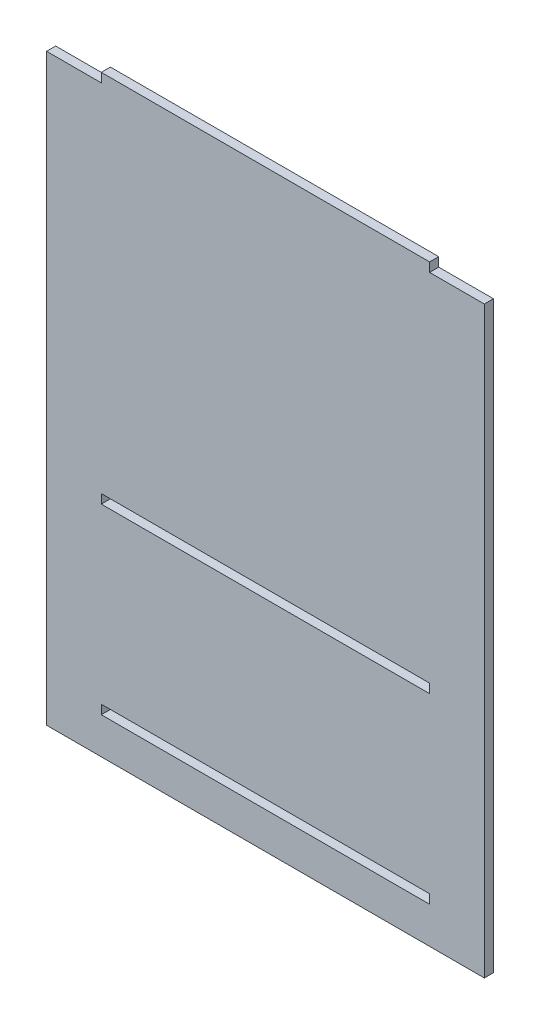
ISO-10303-21;
HEADER;
FILE_DESCRIPTION(('STEP AP214'),'2;1');
FILE_NAME('part.step','',(''),(''),'','','');
FILE_SCHEMA(('AUTOMOTIVE_DESIGN { 1 0 10303 214 1 1 1 1 }'));
ENDSEC;
DATA;
#1=APPLICATION_CONTEXT('core data for automotive mechanical design processes');
#2=APPLICATION_PROTOCOL_DEFINITION('international standard','automotive_design',2000,#1);
#3=PRODUCT_CONTEXT('',#1,'mechanical');
#4=PRODUCT('Part','Part','',(#3));
#5=PRODUCT_RELATED_PRODUCT_CATEGORY('part','',(#4));
#6=PRODUCT_DEFINITION_FORMATION('','',#4);
#7=PRODUCT_DEFINITION_CONTEXT('part definition',#1,'design');
#8=PRODUCT_DEFINITION('design','',#6,#7);
#9=PRODUCT_DEFINITION_SHAPE('','',#8);
#10=(LENGTH_UNIT() NAMED_UNIT(*) SI_UNIT(.MILLI.,.METRE.));
#11=(NAMED_UNIT(*) PLANE_ANGLE_UNIT() SI_UNIT($,.RADIAN.));
#12=(NAMED_UNIT(*) SI_UNIT($,.STERADIAN.) SOLID_ANGLE_UNIT());
#13=UNCERTAINTY_MEASURE_WITH_UNIT(LENGTH_MEASURE(1.E-05),#10,'distance_accuracy_value','');
#14=(GEOMETRIC_REPRESENTATION_CONTEXT(3) GLOBAL_UNCERTAINTY_ASSIGNED_CONTEXT((#13)) GLOBAL_UNIT_ASSIGNED_CONTEXT((#10,
#11,#12)) REPRESENTATION_CONTEXT('',''));
#15=CARTESIAN_POINT('',(0.,0.,0.));
#16=DIRECTION('',(0.,0.,1.));
#17=DIRECTION('',(1.,0.,0.));
#18=AXIS2_PLACEMENT_3D('',#15,#16,#17);
#19=CARTESIAN_POINT('',(0.,0.,3.175));
#20=DIRECTION('',(0.,0.,-1.));
#21=DIRECTION('',(-1.,0.,0.));
#22=AXIS2_PLACEMENT_3D('',#19,#20,#21);
#23=PLANE('',#22);
#24=DIRECTION('',(0.,-1.,0.));
#25=VECTOR('',#24,1.);
#26=CARTESIAN_POINT('',(19.05,79.375,3.175));
#27=LINE('',#26,#25);
#28=CARTESIAN_POINT('',(19.05,79.375,3.175));
#29=VERTEX_POINT('',#28);
#30=CARTESIAN_POINT('',(19.05,76.2,3.175));
#31=VERTEX_POINT('',#30);
#32=EDGE_CURVE('E184',#29,#31,#27,.T.);
#33=ORIENTED_EDGE('',*,*,#32,.F.);
#34=DIRECTION('',(-1.,0.,0.));
#35=VECTOR('',#34,1.);
#36=CARTESIAN_POINT('',(19.05,79.375,3.175));
#37=LINE('',#36,#35);
#38=CARTESIAN_POINT('',(133.35,79.375,3.175));
#39=VERTEX_POINT('',#38);
#40=EDGE_CURVE('E192',#39,#29,#37,.T.);
#41=ORIENTED_EDGE('',*,*,#40,.F.);
#42=DIRECTION('',(0.,1.,0.));
#43=VECTOR('',#42,1.);
#44=CARTESIAN_POINT('',(133.35,79.375,3.175));
#45=LINE('',#44,#43);
#46=CARTESIAN_POINT('',(133.35,76.2,3.175));
#47=VERTEX_POINT('',#46);
#48=EDGE_CURVE('E189',#47,#39,#45,.T.);
#49=ORIENTED_EDGE('',*,*,#48,.F.);
#50=DIRECTION('',(1.,0.,0.));
#51=VECTOR('',#50,1.);
#52=CARTESIAN_POINT('',(19.05,76.2,3.175));
#53=LINE('',#52,#51);
#54=EDGE_CURVE('E186',#31,#47,#53,.T.);
#55=ORIENTED_EDGE('',*,*,#54,.F.);
#56=EDGE_LOOP('',(#33,#41,#49,#55));
#57=FACE_BOUND('',#56,.T.);
#58=DIRECTION('',(0.,-1.,0.));
#59=VECTOR('',#58,1.);
#60=CARTESIAN_POINT('',(0.,0.,3.175));
#61=LINE('',#60,#59);
#62=CARTESIAN_POINT('',(0.,203.2,3.175));
#63=VERTEX_POINT('',#62);
#64=CARTESIAN_POINT('',(0.,0.,3.175));
#65=VERTEX_POINT('',#64);
#66=EDGE_CURVE('E215',#63,#65,#61,.T.);
#67=ORIENTED_EDGE('',*,*,#66,.T.);
#68=DIRECTION('',(1.,0.,0.));
#69=VECTOR('',#68,1.);
#70=CARTESIAN_POINT('',(0.,0.,3.175));
#71=LINE('',#70,#69);
#72=CARTESIAN_POINT('',(152.4,0.,3.175));
#73=VERTEX_POINT('',#72);
#74=EDGE_CURVE('E218',#65,#73,#71,.T.);
#75=ORIENTED_EDGE('',*,*,#74,.T.);
#76=DIRECTION('',(0.,1.,0.));
#77=VECTOR('',#76,1.);
#78=CARTESIAN_POINT('',(152.4,0.,3.175));
#79=LINE('',#78,#77);
#80=CARTESIAN_POINT('',(152.4,203.2,3.175));
#81=VERTEX_POINT('',#80);
#82=EDGE_CURVE('E221',#73,#81,#79,.T.);
#83=ORIENTED_EDGE('',*,*,#82,.T.);
#84=DIRECTION('',(-1.,0.,0.));
#85=VECTOR('',#84,1.);
#86=CARTESIAN_POINT('',(133.35,203.2,3.175));
#87=LINE('',#86,#85);
#88=CARTESIAN_POINT('',(133.35,203.2,3.175));
#89=VERTEX_POINT('',#88);
#90=EDGE_CURVE('E223',#81,#89,#87,.T.);
#91=ORIENTED_EDGE('',*,*,#90,.T.);
#92=DIRECTION('',(0.,1.,0.));
#93=VECTOR('',#92,1.);
#94=CARTESIAN_POINT('',(133.35,203.2,3.175));
#95=LINE('',#94,#93);
#96=CARTESIAN_POINT('',(133.35,206.375,3.175));
#97=VERTEX_POINT('',#96);
#98=EDGE_CURVE('E225',#89,#97,#95,.T.);
#99=ORIENTED_EDGE('',*,*,#98,.T.);
#100=DIRECTION('',(-1.,0.,0.));
#101=VECTOR('',#100,1.);
#102=CARTESIAN_POINT('',(19.05,206.375,3.175));
#103=LINE('',#102,#101);
#104=CARTESIAN_POINT('',(19.05,206.375,3.175));
#105=VERTEX_POINT('',#104);
#106=EDGE_CURVE('E227',#97,#105,#103,.T.);
#107=ORIENTED_EDGE('',*,*,#106,.T.);
#108=DIRECTION('',(0.,-1.,0.));
#109=VECTOR('',#108,1.);
#110=CARTESIAN_POINT('',(19.05,203.2,3.175));
#111=LINE('',#110,#109);
#112=CARTESIAN_POINT('',(19.05,203.2,3.175));
#113=VERTEX_POINT('',#112);
#114=EDGE_CURVE('E229',#105,#113,#111,.T.);
#115=ORIENTED_EDGE('',*,*,#114,.T.);
#116=DIRECTION('',(-1.,0.,0.));
#117=VECTOR('',#116,1.);
#118=CARTESIAN_POINT('',(0.,203.2,3.175));
#119=LINE('',#118,#117);
#120=EDGE_CURVE('E231',#113,#63,#119,.T.);
#121=ORIENTED_EDGE('',*,*,#120,.T.);
#122=EDGE_LOOP('',(#67,#75,#83,#91,#99,#107,#115,#121));
#123=FACE_BOUND('',#122,.T.);
#124=DIRECTION('',(0.,-1.,0.));
#125=VECTOR('',#124,1.);
#126=CARTESIAN_POINT('',(19.05,15.875,3.175));
#127=LINE('',#126,#125);
#128=CARTESIAN_POINT('',(19.05,15.875,3.175));
#129=VERTEX_POINT('',#128);
#130=CARTESIAN_POINT('',(19.05,12.7,3.175));
#131=VERTEX_POINT('',#130);
#132=EDGE_CURVE('E148',#129,#131,#127,.T.);
#133=ORIENTED_EDGE('',*,*,#132,.F.);
#134=DIRECTION('',(-1.,0.,0.));
#135=VECTOR('',#134,1.);
#136=CARTESIAN_POINT('',(19.05,15.875,3.175));
#137=LINE('',#136,#135);
#138=CARTESIAN_POINT('',(133.35,15.875,3.175));
#139=VERTEX_POINT('',#138);
#140=EDGE_CURVE('E170',#139,#129,#137,.T.);
#141=ORIENTED_EDGE('',*,*,#140,.F.);
#142=DIRECTION('',(0.,1.,0.));
#143=VECTOR('',#142,1.);
#144=CARTESIAN_POINT('',(133.35,15.875,3.175));
#145=LINE('',#144,#143);
#146=CARTESIAN_POINT('',(133.35,12.7,3.175));
#147=VERTEX_POINT('',#146);
#148=EDGE_CURVE('E168',#147,#139,#145,.T.);
#149=ORIENTED_EDGE('',*,*,#148,.F.);
#150=DIRECTION('',(1.,0.,0.));
#151=VECTOR('',#150,1.);
#152=CARTESIAN_POINT('',(19.05,12.7,3.175));
#153=LINE('',#152,#151);
#154=EDGE_CURVE('E156',#131,#147,#153,.T.);
#155=ORIENTED_EDGE('',*,*,#154,.F.);
#156=EDGE_LOOP('',(#133,#141,#149,#155));
#157=FACE_BOUND('',#156,.T.);
#158=ADVANCED_FACE('F35',(#57,#123,#157),#23,.F.);
#159=CARTESIAN_POINT('',(0.,0.,0.));
#160=DIRECTION('',(0.,0.,-1.));
#161=DIRECTION('',(-1.,0.,0.));
#162=AXIS2_PLACEMENT_3D('',#159,#160,#161);
#163=PLANE('',#162);
#164=DIRECTION('',(0.,-1.,0.));
#165=VECTOR('',#164,1.);
#166=CARTESIAN_POINT('',(0.,0.,0.));
#167=LINE('',#166,#165);
#168=CARTESIAN_POINT('',(0.,203.2,0.));
#169=VERTEX_POINT('',#168);
#170=CARTESIAN_POINT('',(0.,0.,0.));
#171=VERTEX_POINT('',#170);
#172=EDGE_CURVE('E214',#169,#171,#167,.T.);
#173=ORIENTED_EDGE('',*,*,#172,.F.);
#174=DIRECTION('',(-1.,0.,0.));
#175=VECTOR('',#174,1.);
#176=CARTESIAN_POINT('',(0.,203.2,0.));
#177=LINE('',#176,#175);
#178=CARTESIAN_POINT('',(19.05,203.2,0.));
#179=VERTEX_POINT('',#178);
#180=EDGE_CURVE('E219',#179,#169,#177,.T.);
#181=ORIENTED_EDGE('',*,*,#180,.F.);
#182=DIRECTION('',(0.,-1.,0.));
#183=VECTOR('',#182,1.);
#184=CARTESIAN_POINT('',(19.05,203.2,0.));
#185=LINE('',#184,#183);
#186=CARTESIAN_POINT('',(19.05,206.375,0.));
#187=VERTEX_POINT('',#186);
#188=EDGE_CURVE('E246',#187,#179,#185,.T.);
#189=ORIENTED_EDGE('',*,*,#188,.F.);
#190=DIRECTION('',(-1.,0.,0.));
#191=VECTOR('',#190,1.);
#192=CARTESIAN_POINT('',(19.05,206.375,0.));
#193=LINE('',#192,#191);
#194=CARTESIAN_POINT('',(133.35,206.375,0.));
#195=VERTEX_POINT('',#194);
#196=EDGE_CURVE('E244',#195,#187,#193,.T.);
#197=ORIENTED_EDGE('',*,*,#196,.F.);
#198=DIRECTION('',(0.,1.,0.));
#199=VECTOR('',#198,1.);
#200=CARTESIAN_POINT('',(133.35,203.2,0.));
#201=LINE('',#200,#199);
#202=CARTESIAN_POINT('',(133.35,203.2,0.));
#203=VERTEX_POINT('',#202);
#204=EDGE_CURVE('E242',#203,#195,#201,.T.);
#205=ORIENTED_EDGE('',*,*,#204,.F.);
#206=DIRECTION('',(-1.,0.,0.));
#207=VECTOR('',#206,1.);
#208=CARTESIAN_POINT('',(133.35,203.2,0.));
#209=LINE('',#208,#207);
#210=CARTESIAN_POINT('',(152.4,203.2,0.));
#211=VERTEX_POINT('',#210);
#212=EDGE_CURVE('E240',#211,#203,#209,.T.);
#213=ORIENTED_EDGE('',*,*,#212,.F.);
#214=DIRECTION('',(0.,1.,0.));
#215=VECTOR('',#214,1.);
#216=CARTESIAN_POINT('',(152.4,0.,0.));
#217=LINE('',#216,#215);
#218=CARTESIAN_POINT('',(152.4,0.,0.));
#219=VERTEX_POINT('',#218);
#220=EDGE_CURVE('E238',#219,#211,#217,.T.);
#221=ORIENTED_EDGE('',*,*,#220,.F.);
#222=DIRECTION('',(1.,0.,0.));
#223=VECTOR('',#222,1.);
#224=CARTESIAN_POINT('',(133.35,0.,0.));
#225=LINE('',#224,#223);
#226=EDGE_CURVE('E236',#171,#219,#225,.T.);
#227=ORIENTED_EDGE('',*,*,#226,.F.);
#228=EDGE_LOOP('',(#173,#181,#189,#197,#205,#213,#221,#227));
#229=FACE_BOUND('',#228,.T.);
#230=DIRECTION('',(-1.,0.,0.));
#231=VECTOR('',#230,1.);
#232=CARTESIAN_POINT('',(19.05,79.375,0.));
#233=LINE('',#232,#231);
#234=CARTESIAN_POINT('',(133.35,79.375,0.));
#235=VERTEX_POINT('',#234);
#236=CARTESIAN_POINT('',(19.05,79.375,0.));
#237=VERTEX_POINT('',#236);
#238=EDGE_CURVE('E187',#235,#237,#233,.T.);
#239=ORIENTED_EDGE('',*,*,#238,.T.);
#240=DIRECTION('',(0.,-1.,0.));
#241=VECTOR('',#240,1.);
#242=CARTESIAN_POINT('',(19.05,79.375,0.));
#243=LINE('',#242,#241);
#244=CARTESIAN_POINT('',(19.05,76.2,0.));
#245=VERTEX_POINT('',#244);
#246=EDGE_CURVE('E164',#237,#245,#243,.T.);
#247=ORIENTED_EDGE('',*,*,#246,.T.);
#248=DIRECTION('',(1.,0.,0.));
#249=VECTOR('',#248,1.);
#250=CARTESIAN_POINT('',(19.05,76.2,0.));
#251=LINE('',#250,#249);
#252=CARTESIAN_POINT('',(133.35,76.2,0.));
#253=VERTEX_POINT('',#252);
#254=EDGE_CURVE('E197',#245,#253,#251,.T.);
#255=ORIENTED_EDGE('',*,*,#254,.T.);
#256=DIRECTION('',(0.,1.,0.));
#257=VECTOR('',#256,1.);
#258=CARTESIAN_POINT('',(133.35,79.375,0.));
#259=LINE('',#258,#257);
#260=EDGE_CURVE('E200',#253,#235,#259,.T.);
#261=ORIENTED_EDGE('',*,*,#260,.T.);
#262=EDGE_LOOP('',(#239,#247,#255,#261));
#263=FACE_BOUND('',#262,.T.);
#264=DIRECTION('',(-1.,0.,0.));
#265=VECTOR('',#264,1.);
#266=CARTESIAN_POINT('',(19.05,15.875,0.));
#267=LINE('',#266,#265);
#268=CARTESIAN_POINT('',(133.35,15.875,0.));
#269=VERTEX_POINT('',#268);
#270=CARTESIAN_POINT('',(19.05,15.875,0.));
#271=VERTEX_POINT('',#270);
#272=EDGE_CURVE('E157',#269,#271,#267,.T.);
#273=ORIENTED_EDGE('',*,*,#272,.T.);
#274=DIRECTION('',(0.,-1.,0.));
#275=VECTOR('',#274,1.);
#276=CARTESIAN_POINT('',(19.05,15.875,0.));
#277=LINE('',#276,#275);
#278=CARTESIAN_POINT('',(19.05,12.7,0.));
#279=VERTEX_POINT('',#278);
#280=EDGE_CURVE('E58',#271,#279,#277,.T.);
#281=ORIENTED_EDGE('',*,*,#280,.T.);
#282=DIRECTION('',(1.,0.,0.));
#283=VECTOR('',#282,1.);
#284=CARTESIAN_POINT('',(19.05,12.7,0.));
#285=LINE('',#284,#283);
#286=CARTESIAN_POINT('',(133.35,12.7,0.));
#287=VERTEX_POINT('',#286);
#288=EDGE_CURVE('E163',#279,#287,#285,.T.);
#289=ORIENTED_EDGE('',*,*,#288,.T.);
#290=DIRECTION('',(0.,1.,0.));
#291=VECTOR('',#290,1.);
#292=CARTESIAN_POINT('',(133.35,15.875,0.));
#293=LINE('',#292,#291);
#294=EDGE_CURVE('E176',#287,#269,#293,.T.);
#295=ORIENTED_EDGE('',*,*,#294,.T.);
#296=EDGE_LOOP('',(#273,#281,#289,#295));
#297=FACE_BOUND('',#296,.T.);
#298=ADVANCED_FACE('F276',(#229,#263,#297),#163,.T.);
#299=CARTESIAN_POINT('',(0.,0.,3.175));
#300=DIRECTION('',(1.,0.,0.));
#301=DIRECTION('',(0.,0.,-1.));
#302=AXIS2_PLACEMENT_3D('',#299,#300,#301);
#303=PLANE('',#302);
#304=ORIENTED_EDGE('',*,*,#172,.T.);
#305=DIRECTION('',(0.,0.,-1.));
#306=VECTOR('',#305,1.);
#307=CARTESIAN_POINT('',(0.,0.,3.175));
#308=LINE('',#307,#306);
#309=EDGE_CURVE('E11',#65,#171,#308,.T.);
#310=ORIENTED_EDGE('',*,*,#309,.F.);
#311=ORIENTED_EDGE('',*,*,#66,.F.);
#312=DIRECTION('',(0.,0.,-1.));
#313=VECTOR('',#312,1.);
#314=CARTESIAN_POINT('',(0.,203.2,3.175));
#315=LINE('',#314,#313);
#316=EDGE_CURVE('E233',#63,#169,#315,.T.);
#317=ORIENTED_EDGE('',*,*,#316,.T.);
#318=EDGE_LOOP('',(#304,#310,#311,#317));
#319=FACE_BOUND('',#318,.T.);
#320=ADVANCED_FACE('F37',(#319),#303,.F.);
#321=CARTESIAN_POINT('',(133.35,0.,3.175));
#322=DIRECTION('',(0.,1.,0.));
#323=DIRECTION('',(0.,0.,1.));
#324=AXIS2_PLACEMENT_3D('',#321,#322,#323);
#325=PLANE('',#324);
#326=ORIENTED_EDGE('',*,*,#226,.T.);
#327=DIRECTION('',(0.,0.,-1.));
#328=VECTOR('',#327,1.);
#329=CARTESIAN_POINT('',(152.4,0.,3.175));
#330=LINE('',#329,#328);
#331=EDGE_CURVE('E43',#73,#219,#330,.T.);
#332=ORIENTED_EDGE('',*,*,#331,.F.);
#333=ORIENTED_EDGE('',*,*,#74,.F.);
#334=ORIENTED_EDGE('',*,*,#309,.T.);
#335=EDGE_LOOP('',(#326,#332,#333,#334));
#336=FACE_BOUND('',#335,.T.);
#337=ADVANCED_FACE('F293',(#336),#325,.F.);
#338=CARTESIAN_POINT('',(152.4,0.,3.175));
#339=DIRECTION('',(-1.,0.,0.));
#340=DIRECTION('',(0.,0.,1.));
#341=AXIS2_PLACEMENT_3D('',#338,#339,#340);
#342=PLANE('',#341);
#343=ORIENTED_EDGE('',*,*,#220,.T.);
#344=DIRECTION('',(0.,0.,-1.));
#345=VECTOR('',#344,1.);
#346=CARTESIAN_POINT('',(152.4,203.2,3.175));
#347=LINE('',#346,#345);
#348=EDGE_CURVE('E263',#81,#211,#347,.T.);
#349=ORIENTED_EDGE('',*,*,#348,.F.);
#350=ORIENTED_EDGE('',*,*,#82,.F.);
#351=ORIENTED_EDGE('',*,*,#331,.T.);
#352=EDGE_LOOP('',(#343,#349,#350,#351));
#353=FACE_BOUND('',#352,.T.);
#354=ADVANCED_FACE('F270',(#353),#342,.F.);
#355=CARTESIAN_POINT('',(133.35,203.2,3.175));
#356=DIRECTION('',(0.,-1.,0.));
#357=DIRECTION('',(0.,0.,-1.));
#358=AXIS2_PLACEMENT_3D('',#355,#356,#357);
#359=PLANE('',#358);
#360=ORIENTED_EDGE('',*,*,#212,.T.);
#361=DIRECTION('',(0.,0.,-1.));
#362=VECTOR('',#361,1.);
#363=CARTESIAN_POINT('',(133.35,203.2,3.175));
#364=LINE('',#363,#362);
#365=EDGE_CURVE('E260',#89,#203,#364,.T.);
#366=ORIENTED_EDGE('',*,*,#365,.F.);
#367=ORIENTED_EDGE('',*,*,#90,.F.);
#368=ORIENTED_EDGE('',*,*,#348,.T.);
#369=EDGE_LOOP('',(#360,#366,#367,#368));
#370=FACE_BOUND('',#369,.T.);
#371=ADVANCED_FACE('F282',(#370),#359,.F.);
#372=CARTESIAN_POINT('',(133.35,203.2,3.175));
#373=DIRECTION('',(-1.,0.,0.));
#374=DIRECTION('',(0.,0.,1.));
#375=AXIS2_PLACEMENT_3D('',#372,#373,#374);
#376=PLANE('',#375);
#377=ORIENTED_EDGE('',*,*,#204,.T.);
#378=DIRECTION('',(0.,0.,-1.));
#379=VECTOR('',#378,1.);
#380=CARTESIAN_POINT('',(133.35,206.375,3.175));
#381=LINE('',#380,#379);
#382=EDGE_CURVE('E257',#97,#195,#381,.T.);
#383=ORIENTED_EDGE('',*,*,#382,.F.);
#384=ORIENTED_EDGE('',*,*,#98,.F.);
#385=ORIENTED_EDGE('',*,*,#365,.T.);
#386=EDGE_LOOP('',(#377,#383,#384,#385));
#387=FACE_BOUND('',#386,.T.);
#388=ADVANCED_FACE('F286',(#387),#376,.F.);
#389=CARTESIAN_POINT('',(19.05,206.375,3.175));
#390=DIRECTION('',(0.,-1.,0.));
#391=DIRECTION('',(0.,0.,-1.));
#392=AXIS2_PLACEMENT_3D('',#389,#390,#391);
#393=PLANE('',#392);
#394=ORIENTED_EDGE('',*,*,#196,.T.);
#395=DIRECTION('',(0.,0.,-1.));
#396=VECTOR('',#395,1.);
#397=CARTESIAN_POINT('',(19.05,206.375,3.175));
#398=LINE('',#397,#396);
#399=EDGE_CURVE('E254',#105,#187,#398,.T.);
#400=ORIENTED_EDGE('',*,*,#399,.F.);
#401=ORIENTED_EDGE('',*,*,#106,.F.);
#402=ORIENTED_EDGE('',*,*,#382,.T.);
#403=EDGE_LOOP('',(#394,#400,#401,#402));
#404=FACE_BOUND('',#403,.T.);
#405=ADVANCED_FACE('F306',(#404),#393,.F.);
#406=CARTESIAN_POINT('',(19.05,203.2,3.175));
#407=DIRECTION('',(1.,0.,0.));
#408=DIRECTION('',(0.,1.,0.));
#409=AXIS2_PLACEMENT_3D('',#406,#407,#408);
#410=PLANE('',#409);
#411=ORIENTED_EDGE('',*,*,#188,.T.);
#412=DIRECTION('',(0.,0.,-1.));
#413=VECTOR('',#412,1.);
#414=CARTESIAN_POINT('',(19.05,203.2,3.175));
#415=LINE('',#414,#413);
#416=EDGE_CURVE('E251',#113,#179,#415,.T.);
#417=ORIENTED_EDGE('',*,*,#416,.F.);
#418=ORIENTED_EDGE('',*,*,#114,.F.);
#419=ORIENTED_EDGE('',*,*,#399,.T.);
#420=EDGE_LOOP('',(#411,#417,#418,#419));
#421=FACE_BOUND('',#420,.T.);
#422=ADVANCED_FACE('F304',(#421),#410,.F.);
#423=CARTESIAN_POINT('',(0.,203.2,3.175));
#424=DIRECTION('',(0.,-1.,0.));
#425=DIRECTION('',(0.,0.,-1.));
#426=AXIS2_PLACEMENT_3D('',#423,#424,#425);
#427=PLANE('',#426);
#428=ORIENTED_EDGE('',*,*,#180,.T.);
#429=ORIENTED_EDGE('',*,*,#316,.F.);
#430=ORIENTED_EDGE('',*,*,#120,.F.);
#431=ORIENTED_EDGE('',*,*,#416,.T.);
#432=EDGE_LOOP('',(#428,#429,#430,#431));
#433=FACE_BOUND('',#432,.T.);
#434=ADVANCED_FACE('F299',(#433),#427,.F.);
#435=CARTESIAN_POINT('',(19.05,79.375,3.175));
#436=DIRECTION('',(1.,0.,0.));
#437=DIRECTION('',(0.,0.,-1.));
#438=AXIS2_PLACEMENT_3D('',#435,#436,#437);
#439=PLANE('',#438);
#440=ORIENTED_EDGE('',*,*,#246,.F.);
#441=DIRECTION('',(0.,0.,-1.));
#442=VECTOR('',#441,1.);
#443=CARTESIAN_POINT('',(19.05,79.375,3.175));
#444=LINE('',#443,#442);
#445=EDGE_CURVE('E194',#29,#237,#444,.T.);
#446=ORIENTED_EDGE('',*,*,#445,.F.);
#447=ORIENTED_EDGE('',*,*,#32,.T.);
#448=DIRECTION('',(0.,0.,-1.));
#449=VECTOR('',#448,1.);
#450=CARTESIAN_POINT('',(19.05,76.2,3.175));
#451=LINE('',#450,#449);
#452=EDGE_CURVE('E211',#31,#245,#451,.T.);
#453=ORIENTED_EDGE('',*,*,#452,.T.);
#454=EDGE_LOOP('',(#440,#446,#447,#453));
#455=FACE_BOUND('',#454,.T.);
#456=ADVANCED_FACE('F324',(#455),#439,.T.);
#457=CARTESIAN_POINT('',(19.05,76.2,3.175));
#458=DIRECTION('',(0.,1.,0.));
#459=DIRECTION('',(0.,0.,1.));
#460=AXIS2_PLACEMENT_3D('',#457,#458,#459);
#461=PLANE('',#460);
#462=ORIENTED_EDGE('',*,*,#254,.F.);
#463=ORIENTED_EDGE('',*,*,#452,.F.);
#464=ORIENTED_EDGE('',*,*,#54,.T.);
#465=DIRECTION('',(0.,0.,-1.));
#466=VECTOR('',#465,1.);
#467=CARTESIAN_POINT('',(133.35,76.2,3.175));
#468=LINE('',#467,#466);
#469=EDGE_CURVE('E209',#47,#253,#468,.T.);
#470=ORIENTED_EDGE('',*,*,#469,.T.);
#471=EDGE_LOOP('',(#462,#463,#464,#470));
#472=FACE_BOUND('',#471,.T.);
#473=ADVANCED_FACE('F331',(#472),#461,.T.);
#474=CARTESIAN_POINT('',(133.35,79.375,3.175));
#475=DIRECTION('',(-1.,0.,0.));
#476=DIRECTION('',(0.,0.,1.));
#477=AXIS2_PLACEMENT_3D('',#474,#475,#476);
#478=PLANE('',#477);
#479=ORIENTED_EDGE('',*,*,#260,.F.);
#480=ORIENTED_EDGE('',*,*,#469,.F.);
#481=ORIENTED_EDGE('',*,*,#48,.T.);
#482=DIRECTION('',(0.,0.,-1.));
#483=VECTOR('',#482,1.);
#484=CARTESIAN_POINT('',(133.35,79.375,3.175));
#485=LINE('',#484,#483);
#486=EDGE_CURVE('E207',#39,#235,#485,.T.);
#487=ORIENTED_EDGE('',*,*,#486,.T.);
#488=EDGE_LOOP('',(#479,#480,#481,#487));
#489=FACE_BOUND('',#488,.T.);
#490=ADVANCED_FACE('F336',(#489),#478,.T.);
#491=CARTESIAN_POINT('',(19.05,79.375,3.175));
#492=DIRECTION('',(0.,-1.,0.));
#493=DIRECTION('',(0.,0.,-1.));
#494=AXIS2_PLACEMENT_3D('',#491,#492,#493);
#495=PLANE('',#494);
#496=ORIENTED_EDGE('',*,*,#238,.F.);
#497=ORIENTED_EDGE('',*,*,#486,.F.);
#498=ORIENTED_EDGE('',*,*,#40,.T.);
#499=ORIENTED_EDGE('',*,*,#445,.T.);
#500=EDGE_LOOP('',(#496,#497,#498,#499));
#501=FACE_BOUND('',#500,.T.);
#502=ADVANCED_FACE('F342',(#501),#495,.T.);
#503=CARTESIAN_POINT('',(19.05,15.875,3.175));
#504=DIRECTION('',(1.,0.,0.));
#505=DIRECTION('',(0.,0.,-1.));
#506=AXIS2_PLACEMENT_3D('',#503,#504,#505);
#507=PLANE('',#506);
#508=ORIENTED_EDGE('',*,*,#280,.F.);
#509=DIRECTION('',(0.,0.,-1.));
#510=VECTOR('',#509,1.);
#511=CARTESIAN_POINT('',(19.05,15.875,3.175));
#512=LINE('',#511,#510);
#513=EDGE_CURVE('E152',#129,#271,#512,.T.);
#514=ORIENTED_EDGE('',*,*,#513,.F.);
#515=ORIENTED_EDGE('',*,*,#132,.T.);
#516=DIRECTION('',(0.,0.,-1.));
#517=VECTOR('',#516,1.);
#518=CARTESIAN_POINT('',(19.05,12.7,3.175));
#519=LINE('',#518,#517);
#520=EDGE_CURVE('E151',#131,#279,#519,.T.);
#521=ORIENTED_EDGE('',*,*,#520,.T.);
#522=EDGE_LOOP('',(#508,#514,#515,#521));
#523=FACE_BOUND('',#522,.T.);
#524=ADVANCED_FACE('F150',(#523),#507,.T.);
#525=CARTESIAN_POINT('',(19.05,12.7,3.175));
#526=DIRECTION('',(0.,1.,0.));
#527=DIRECTION('',(0.,0.,1.));
#528=AXIS2_PLACEMENT_3D('',#525,#526,#527);
#529=PLANE('',#528);
#530=ORIENTED_EDGE('',*,*,#288,.F.);
#531=ORIENTED_EDGE('',*,*,#520,.F.);
#532=ORIENTED_EDGE('',*,*,#154,.T.);
#533=DIRECTION('',(0.,0.,-1.));
#534=VECTOR('',#533,1.);
#535=CARTESIAN_POINT('',(133.35,12.7,3.175));
#536=LINE('',#535,#534);
#537=EDGE_CURVE('E165',#147,#287,#536,.T.);
#538=ORIENTED_EDGE('',*,*,#537,.T.);
#539=EDGE_LOOP('',(#530,#531,#532,#538));
#540=FACE_BOUND('',#539,.T.);
#541=ADVANCED_FACE('F160',(#540),#529,.T.);
#542=CARTESIAN_POINT('',(133.35,15.875,3.175));
#543=DIRECTION('',(-1.,0.,0.));
#544=DIRECTION('',(0.,0.,1.));
#545=AXIS2_PLACEMENT_3D('',#542,#543,#544);
#546=PLANE('',#545);
#547=ORIENTED_EDGE('',*,*,#294,.F.);
#548=ORIENTED_EDGE('',*,*,#537,.F.);
#549=ORIENTED_EDGE('',*,*,#148,.T.);
#550=DIRECTION('',(0.,0.,-1.));
#551=VECTOR('',#550,1.);
#552=CARTESIAN_POINT('',(133.35,15.875,3.175));
#553=LINE('',#552,#551);
#554=EDGE_CURVE('E50',#139,#269,#553,.T.);
#555=ORIENTED_EDGE('',*,*,#554,.T.);
#556=EDGE_LOOP('',(#547,#548,#549,#555));
#557=FACE_BOUND('',#556,.T.);
#558=ADVANCED_FACE('F361',(#557),#546,.T.);
#559=CARTESIAN_POINT('',(19.05,15.875,3.175));
#560=DIRECTION('',(0.,-1.,0.));
#561=DIRECTION('',(0.,0.,-1.));
#562=AXIS2_PLACEMENT_3D('',#559,#560,#561);
#563=PLANE('',#562);
#564=ORIENTED_EDGE('',*,*,#272,.F.);
#565=ORIENTED_EDGE('',*,*,#554,.F.);
#566=ORIENTED_EDGE('',*,*,#140,.T.);
#567=ORIENTED_EDGE('',*,*,#513,.T.);
#568=EDGE_LOOP('',(#564,#565,#566,#567));
#569=FACE_BOUND('',#568,.T.);
#570=ADVANCED_FACE('F364',(#569),#563,.T.);
#571=CLOSED_SHELL('',(#158,#298,#320,#337,#354,#371,#388,#405,#422,#434,#456,#473,#490,#502,
#524,#541,#558,#570));
#572=MANIFOLD_SOLID_BREP('B2',#571);
#573=ADVANCED_BREP_SHAPE_REPRESENTATION('',(#18,#572),#14);
#574=SHAPE_DEFINITION_REPRESENTATION(#9,#573);
ENDSEC;
END-ISO-10303-21;
